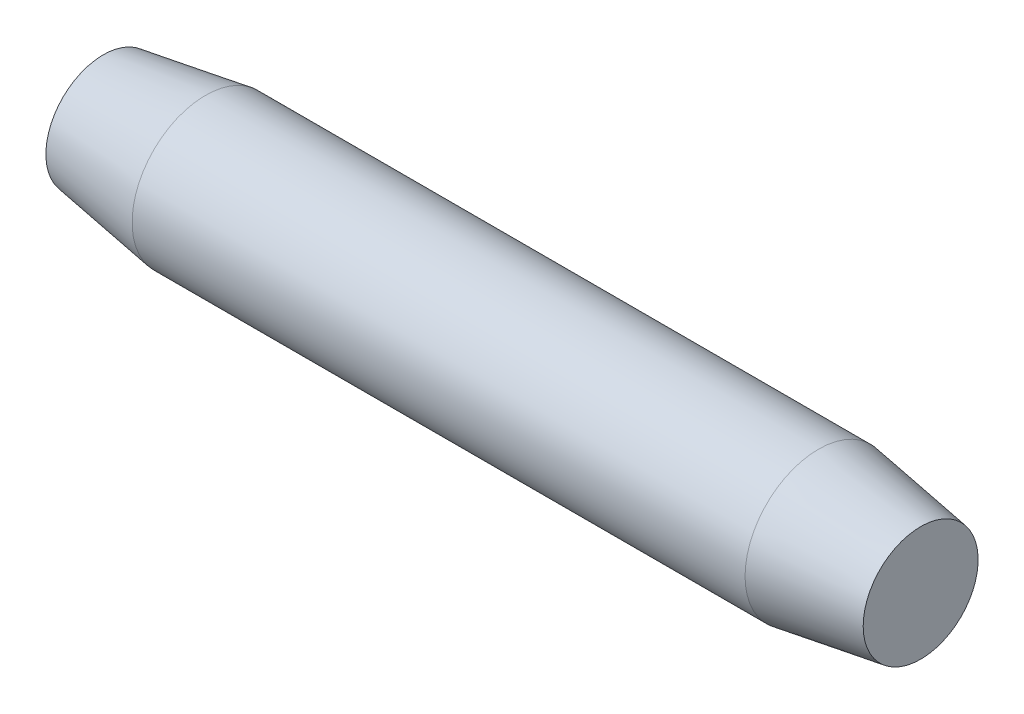
ISO-10303-21;
HEADER;
FILE_DESCRIPTION(('STEP AP214'),'2;1');
FILE_NAME('part.step','',(''),(''),'','','');
FILE_SCHEMA(('AUTOMOTIVE_DESIGN { 1 0 10303 214 1 1 1 1 }'));
ENDSEC;
DATA;
#1=APPLICATION_CONTEXT('core data for automotive mechanical design processes');
#2=APPLICATION_PROTOCOL_DEFINITION('international standard','automotive_design',2000,#1);
#3=PRODUCT_CONTEXT('',#1,'mechanical');
#4=PRODUCT('Part','Part','',(#3));
#5=PRODUCT_RELATED_PRODUCT_CATEGORY('part','',(#4));
#6=PRODUCT_DEFINITION_FORMATION('','',#4);
#7=PRODUCT_DEFINITION_CONTEXT('part definition',#1,'design');
#8=PRODUCT_DEFINITION('design','',#6,#7);
#9=PRODUCT_DEFINITION_SHAPE('','',#8);
#10=(LENGTH_UNIT() NAMED_UNIT(*) SI_UNIT(.MILLI.,.METRE.));
#11=(NAMED_UNIT(*) PLANE_ANGLE_UNIT() SI_UNIT($,.RADIAN.));
#12=(NAMED_UNIT(*) SI_UNIT($,.STERADIAN.) SOLID_ANGLE_UNIT());
#13=UNCERTAINTY_MEASURE_WITH_UNIT(LENGTH_MEASURE(1.E-05),#10,'distance_accuracy_value','');
#14=(GEOMETRIC_REPRESENTATION_CONTEXT(3) GLOBAL_UNCERTAINTY_ASSIGNED_CONTEXT((#13)) GLOBAL_UNIT_ASSIGNED_CONTEXT((#10,
#11,#12)) REPRESENTATION_CONTEXT('',''));
#15=CARTESIAN_POINT('',(0.,0.,0.));
#16=DIRECTION('',(0.,0.,1.));
#17=DIRECTION('',(1.,0.,0.));
#18=AXIS2_PLACEMENT_3D('',#15,#16,#17);
#19=CARTESIAN_POINT('',(0.,0.,0.));
#20=DIRECTION('',(1.,0.,0.));
#21=DIRECTION('',(0.,0.,-1.));
#22=AXIS2_PLACEMENT_3D('',#19,#20,#21);
#23=PLANE('',#22);
#24=CARTESIAN_POINT('',(-1.80411241501588E-13,0.,0.));
#25=DIRECTION('',(1.,0.,0.));
#26=DIRECTION('',(0.,0.,-1.));
#27=AXIS2_PLACEMENT_3D('',#24,#25,#26);
#28=CIRCLE('',#27,14.2938500000012);
#29=CARTESIAN_POINT('',(-1.80411241501588E-13,0.,-14.2938500000012));
#30=VERTEX_POINT('',#29);
#31=EDGE_CURVE('E18',#30,#30,#28,.T.);
#32=ORIENTED_EDGE('',*,*,#31,.F.);
#33=EDGE_LOOP('',(#32));
#34=FACE_BOUND('',#33,.T.);
#35=ADVANCED_FACE('F15',(#34),#23,.F.);
#36=CARTESIAN_POINT('',(203.2,0.,0.));
#37=DIRECTION('',(1.,0.,0.));
#38=DIRECTION('',(0.,0.,-1.));
#39=AXIS2_PLACEMENT_3D('',#36,#37,#38);
#40=PLANE('',#39);
#41=CARTESIAN_POINT('',(203.2,0.,0.));
#42=DIRECTION('',(-1.,0.,0.));
#43=DIRECTION('',(0.,0.,1.));
#44=AXIS2_PLACEMENT_3D('',#41,#42,#43);
#45=CIRCLE('',#44,14.2875000000024);
#46=CARTESIAN_POINT('',(203.2,0.,14.2875000000024));
#47=VERTEX_POINT('',#46);
#48=EDGE_CURVE('E27',#47,#47,#45,.T.);
#49=ORIENTED_EDGE('',*,*,#48,.F.);
#50=EDGE_LOOP('',(#49));
#51=FACE_BOUND('',#50,.T.);
#52=ADVANCED_FACE('F38',(#51),#40,.T.);
#53=CARTESIAN_POINT('',(25.3999999999999,0.,0.));
#54=DIRECTION('',(1.,0.,0.));
#55=DIRECTION('',(0.,0.,-1.));
#56=AXIS2_PLACEMENT_3D('',#53,#54,#55);
#57=CONICAL_SURFACE('',#56,18.2562500000003,0.15475269067799);
#58=CARTESIAN_POINT('',(25.4,0.,0.));
#59=DIRECTION('',(1.,0.,0.));
#60=DIRECTION('',(0.,0.,-1.));
#61=AXIS2_PLACEMENT_3D('',#58,#59,#60);
#62=CIRCLE('',#61,18.25625);
#63=CARTESIAN_POINT('',(25.4,0.,-18.25625));
#64=VERTEX_POINT('',#63);
#65=EDGE_CURVE('E22',#64,#64,#62,.T.);
#66=ORIENTED_EDGE('',*,*,#65,.F.);
#67=EDGE_LOOP('',(#66));
#68=FACE_BOUND('',#67,.T.);
#69=ORIENTED_EDGE('',*,*,#31,.T.);
#70=EDGE_LOOP('',(#69));
#71=FACE_BOUND('',#70,.T.);
#72=ADVANCED_FACE('F35',(#68,#71),#57,.T.);
#73=CARTESIAN_POINT('',(177.8,0.,0.));
#74=DIRECTION('',(-1.,0.,0.));
#75=DIRECTION('',(0.,0.,1.));
#76=AXIS2_PLACEMENT_3D('',#73,#74,#75);
#77=CONICAL_SURFACE('',#76,18.2562500000016,0.154996741923907);
#78=CARTESIAN_POINT('',(177.8,0.,0.));
#79=DIRECTION('',(1.,0.,0.));
#80=DIRECTION('',(0.,0.,-1.));
#81=AXIS2_PLACEMENT_3D('',#78,#79,#80);
#82=CIRCLE('',#81,18.25625);
#83=CARTESIAN_POINT('',(177.8,0.,-18.25625));
#84=VERTEX_POINT('',#83);
#85=EDGE_CURVE('E10',#84,#84,#82,.F.);
#86=ORIENTED_EDGE('',*,*,#85,.F.);
#87=EDGE_LOOP('',(#86));
#88=FACE_BOUND('',#87,.T.);
#89=ORIENTED_EDGE('',*,*,#48,.T.);
#90=EDGE_LOOP('',(#89));
#91=FACE_BOUND('',#90,.T.);
#92=ADVANCED_FACE('F46',(#88,#91),#77,.T.);
#93=CARTESIAN_POINT('',(0.,0.,0.));
#94=DIRECTION('',(1.,0.,0.));
#95=DIRECTION('',(0.,0.,-1.));
#96=AXIS2_PLACEMENT_3D('',#93,#94,#95);
#97=CYLINDRICAL_SURFACE('',#96,18.25625);
#98=ORIENTED_EDGE('',*,*,#65,.T.);
#99=EDGE_LOOP('',(#98));
#100=FACE_BOUND('',#99,.T.);
#101=ORIENTED_EDGE('',*,*,#85,.T.);
#102=EDGE_LOOP('',(#101));
#103=FACE_BOUND('',#102,.T.);
#104=ADVANCED_FACE('F44',(#100,#103),#97,.T.);
#105=CLOSED_SHELL('',(#35,#52,#72,#92,#104));
#106=MANIFOLD_SOLID_BREP('B1',#105);
#107=ADVANCED_BREP_SHAPE_REPRESENTATION('',(#18,#106),#14);
#108=SHAPE_DEFINITION_REPRESENTATION(#9,#107);
ENDSEC;
END-ISO-10303-21;
